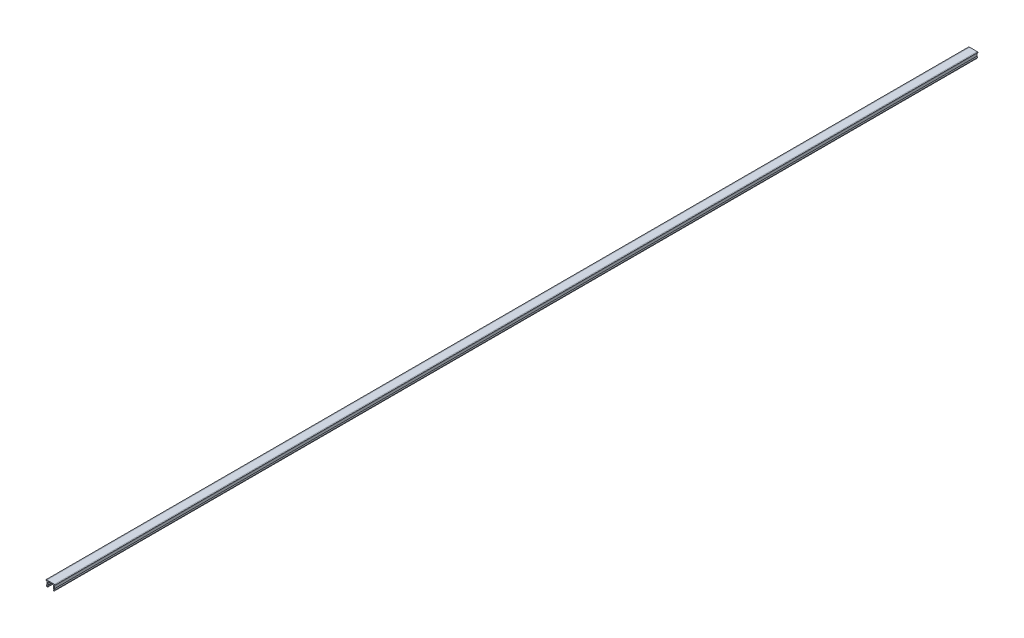
ISO-10303-21;
HEADER;
FILE_DESCRIPTION(('STEP AP214'),'2;1');
FILE_NAME('part.step','',(''),(''),'','','');
FILE_SCHEMA(('AUTOMOTIVE_DESIGN { 1 0 10303 214 1 1 1 1 }'));
ENDSEC;
DATA;
#1=APPLICATION_CONTEXT('core data for automotive mechanical design processes');
#2=APPLICATION_PROTOCOL_DEFINITION('international standard','automotive_design',2000,#1);
#3=PRODUCT_CONTEXT('',#1,'mechanical');
#4=PRODUCT('Part','Part','',(#3));
#5=PRODUCT_RELATED_PRODUCT_CATEGORY('part','',(#4));
#6=PRODUCT_DEFINITION_FORMATION('','',#4);
#7=PRODUCT_DEFINITION_CONTEXT('part definition',#1,'design');
#8=PRODUCT_DEFINITION('design','',#6,#7);
#9=PRODUCT_DEFINITION_SHAPE('','',#8);
#10=(LENGTH_UNIT() NAMED_UNIT(*) SI_UNIT(.MILLI.,.METRE.));
#11=(NAMED_UNIT(*) PLANE_ANGLE_UNIT() SI_UNIT($,.RADIAN.));
#12=(NAMED_UNIT(*) SI_UNIT($,.STERADIAN.) SOLID_ANGLE_UNIT());
#13=UNCERTAINTY_MEASURE_WITH_UNIT(LENGTH_MEASURE(1.E-05),#10,'distance_accuracy_value','');
#14=(GEOMETRIC_REPRESENTATION_CONTEXT(3) GLOBAL_UNCERTAINTY_ASSIGNED_CONTEXT((#13)) GLOBAL_UNIT_ASSIGNED_CONTEXT((#10,
#11,#12)) REPRESENTATION_CONTEXT('',''));
#15=CARTESIAN_POINT('',(0.,0.,0.));
#16=DIRECTION('',(0.,0.,1.));
#17=DIRECTION('',(1.,0.,0.));
#18=AXIS2_PLACEMENT_3D('',#15,#16,#17);
#19=CARTESIAN_POINT('',(-4.1,0.,1000.));
#20=DIRECTION('',(0.,-1.,0.));
#21=DIRECTION('',(1.,0.,0.));
#22=AXIS2_PLACEMENT_3D('',#19,#20,#21);
#23=PLANE('',#22);
#24=DIRECTION('',(-1.,0.,0.));
#25=VECTOR('',#24,1.);
#26=CARTESIAN_POINT('',(-4.1,0.,0.));
#27=LINE('',#26,#25);
#28=CARTESIAN_POINT('',(4.1,0.,0.));
#29=VERTEX_POINT('',#28);
#30=CARTESIAN_POINT('',(-4.1,0.,0.));
#31=VERTEX_POINT('',#30);
#32=EDGE_CURVE('E215',#29,#31,#27,.T.);
#33=ORIENTED_EDGE('',*,*,#32,.T.);
#34=DIRECTION('',(0.,0.,-1.));
#35=VECTOR('',#34,1.);
#36=CARTESIAN_POINT('',(-4.1,0.,1000.));
#37=LINE('',#36,#35);
#38=CARTESIAN_POINT('',(-4.1,0.,1000.));
#39=VERTEX_POINT('',#38);
#40=EDGE_CURVE('E11',#39,#31,#37,.T.);
#41=ORIENTED_EDGE('',*,*,#40,.F.);
#42=DIRECTION('',(-1.,0.,0.));
#43=VECTOR('',#42,1.);
#44=CARTESIAN_POINT('',(-4.1,0.,1000.));
#45=LINE('',#44,#43);
#46=CARTESIAN_POINT('',(4.1,0.,1000.));
#47=VERTEX_POINT('',#46);
#48=EDGE_CURVE('E257',#47,#39,#45,.T.);
#49=ORIENTED_EDGE('',*,*,#48,.F.);
#50=DIRECTION('',(0.,0.,-1.));
#51=VECTOR('',#50,1.);
#52=CARTESIAN_POINT('',(4.1,0.,1000.));
#53=LINE('',#52,#51);
#54=EDGE_CURVE('E211',#47,#29,#53,.T.);
#55=ORIENTED_EDGE('',*,*,#54,.T.);
#56=EDGE_LOOP('',(#33,#41,#49,#55));
#57=FACE_BOUND('',#56,.T.);
#58=ADVANCED_FACE('F35',(#57),#23,.F.);
#59=CARTESIAN_POINT('',(-4.1,0.,1000.));
#60=DIRECTION('',(0.173648177666924,-0.984807753012209,0.));
#61=DIRECTION('',(0.984807753012209,0.173648177666924,0.));
#62=AXIS2_PLACEMENT_3D('',#59,#60,#61);
#63=PLANE('',#62);
#64=DIRECTION('',(-0.984807753012209,-0.173648177666924,0.));
#65=VECTOR('',#64,1.);
#66=CARTESIAN_POINT('',(-4.1,0.,0.));
#67=LINE('',#66,#65);
#68=CARTESIAN_POINT('',(-5.,-0.158694282637612,0.));
#69=VERTEX_POINT('',#68);
#70=EDGE_CURVE('E218',#31,#69,#67,.T.);
#71=ORIENTED_EDGE('',*,*,#70,.T.);
#72=DIRECTION('',(0.,0.,-1.));
#73=VECTOR('',#72,1.);
#74=CARTESIAN_POINT('',(-5.,-0.158694282637612,1000.));
#75=LINE('',#74,#73);
#76=CARTESIAN_POINT('',(-5.,-0.158694282637612,1000.));
#77=VERTEX_POINT('',#76);
#78=EDGE_CURVE('E43',#77,#69,#75,.T.);
#79=ORIENTED_EDGE('',*,*,#78,.F.);
#80=DIRECTION('',(-0.984807753012209,-0.173648177666924,0.));
#81=VECTOR('',#80,1.);
#82=CARTESIAN_POINT('',(-4.1,0.,1000.));
#83=LINE('',#82,#81);
#84=EDGE_CURVE('E136',#39,#77,#83,.T.);
#85=ORIENTED_EDGE('',*,*,#84,.F.);
#86=ORIENTED_EDGE('',*,*,#40,.T.);
#87=EDGE_LOOP('',(#71,#79,#85,#86));
#88=FACE_BOUND('',#87,.T.);
#89=ADVANCED_FACE('F385',(#88),#63,.F.);
#90=CARTESIAN_POINT('',(-5.,-0.158694282637612,1000.));
#91=DIRECTION('',(1.,0.,0.));
#92=DIRECTION('',(0.,0.,-1.));
#93=AXIS2_PLACEMENT_3D('',#90,#91,#92);
#94=PLANE('',#93);
#95=DIRECTION('',(0.,-1.,0.));
#96=VECTOR('',#95,1.);
#97=CARTESIAN_POINT('',(-5.,-0.158694282637612,0.));
#98=LINE('',#97,#96);
#99=CARTESIAN_POINT('',(-5.,-0.8,0.));
#100=VERTEX_POINT('',#99);
#101=EDGE_CURVE('E220',#69,#100,#98,.T.);
#102=ORIENTED_EDGE('',*,*,#101,.T.);
#103=DIRECTION('',(0.,0.,-1.));
#104=VECTOR('',#103,1.);
#105=CARTESIAN_POINT('',(-5.,-0.8,1000.));
#106=LINE('',#105,#104);
#107=CARTESIAN_POINT('',(-5.,-0.8,1000.));
#108=VERTEX_POINT('',#107);
#109=EDGE_CURVE('E306',#108,#100,#106,.T.);
#110=ORIENTED_EDGE('',*,*,#109,.F.);
#111=DIRECTION('',(0.,-1.,0.));
#112=VECTOR('',#111,1.);
#113=CARTESIAN_POINT('',(-5.,-0.158694282637612,1000.));
#114=LINE('',#113,#112);
#115=EDGE_CURVE('E314',#77,#108,#114,.T.);
#116=ORIENTED_EDGE('',*,*,#115,.F.);
#117=ORIENTED_EDGE('',*,*,#78,.T.);
#118=EDGE_LOOP('',(#102,#110,#116,#117));
#119=FACE_BOUND('',#118,.T.);
#120=ADVANCED_FACE('F312',(#119),#94,.F.);
#121=CARTESIAN_POINT('',(-5.,-0.8,1000.));
#122=DIRECTION('',(0.,1.,0.));
#123=DIRECTION('',(0.,0.,1.));
#124=AXIS2_PLACEMENT_3D('',#121,#122,#123);
#125=PLANE('',#124);
#126=DIRECTION('',(1.,0.,0.));
#127=VECTOR('',#126,1.);
#128=CARTESIAN_POINT('',(-5.,-0.8,0.));
#129=LINE('',#128,#127);
#130=CARTESIAN_POINT('',(-4.1,-0.8,0.));
#131=VERTEX_POINT('',#130);
#132=EDGE_CURVE('E222',#100,#131,#129,.T.);
#133=ORIENTED_EDGE('',*,*,#132,.T.);
#134=DIRECTION('',(0.,0.,-1.));
#135=VECTOR('',#134,1.);
#136=CARTESIAN_POINT('',(-4.1,-0.8,1000.));
#137=LINE('',#136,#135);
#138=CARTESIAN_POINT('',(-4.1,-0.8,1000.));
#139=VERTEX_POINT('',#138);
#140=EDGE_CURVE('E303',#139,#131,#137,.T.);
#141=ORIENTED_EDGE('',*,*,#140,.F.);
#142=DIRECTION('',(1.,0.,0.));
#143=VECTOR('',#142,1.);
#144=CARTESIAN_POINT('',(-5.,-0.8,1000.));
#145=LINE('',#144,#143);
#146=EDGE_CURVE('E332',#108,#139,#145,.T.);
#147=ORIENTED_EDGE('',*,*,#146,.F.);
#148=ORIENTED_EDGE('',*,*,#109,.T.);
#149=EDGE_LOOP('',(#133,#141,#147,#148));
#150=FACE_BOUND('',#149,.T.);
#151=ADVANCED_FACE('F323',(#150),#125,.F.);
#152=CARTESIAN_POINT('',(-4.1,-0.8,1000.));
#153=DIRECTION('',(1.,0.,0.));
#154=DIRECTION('',(0.,0.,-1.));
#155=AXIS2_PLACEMENT_3D('',#152,#153,#154);
#156=PLANE('',#155);
#157=DIRECTION('',(0.,-1.,0.));
#158=VECTOR('',#157,1.);
#159=CARTESIAN_POINT('',(-4.1,-0.8,0.));
#160=LINE('',#159,#158);
#161=CARTESIAN_POINT('',(-4.1,-4.19615242270663,0.));
#162=VERTEX_POINT('',#161);
#163=EDGE_CURVE('E224',#131,#162,#160,.T.);
#164=ORIENTED_EDGE('',*,*,#163,.T.);
#165=DIRECTION('',(0.,0.,-1.));
#166=VECTOR('',#165,1.);
#167=CARTESIAN_POINT('',(-4.1,-4.19615242270663,1000.));
#168=LINE('',#167,#166);
#169=CARTESIAN_POINT('',(-4.1,-4.19615242270663,1000.));
#170=VERTEX_POINT('',#169);
#171=EDGE_CURVE('E300',#170,#162,#168,.T.);
#172=ORIENTED_EDGE('',*,*,#171,.F.);
#173=DIRECTION('',(0.,-1.,0.));
#174=VECTOR('',#173,1.);
#175=CARTESIAN_POINT('',(-4.1,-0.8,1000.));
#176=LINE('',#175,#174);
#177=EDGE_CURVE('E329',#139,#170,#176,.T.);
#178=ORIENTED_EDGE('',*,*,#177,.F.);
#179=ORIENTED_EDGE('',*,*,#140,.T.);
#180=EDGE_LOOP('',(#164,#172,#178,#179));
#181=FACE_BOUND('',#180,.T.);
#182=ADVANCED_FACE('F327',(#181),#156,.F.);
#183=CARTESIAN_POINT('',(-4.1,-4.19615242270663,1000.));
#184=DIRECTION('',(0.866025403784438,-0.500000000000001,0.));
#185=DIRECTION('',(0.500000000000001,0.866025403784438,0.));
#186=AXIS2_PLACEMENT_3D('',#183,#184,#185);
#187=PLANE('',#186);
#188=DIRECTION('',(-0.500000000000001,-0.866025403784438,0.));
#189=VECTOR('',#188,1.);
#190=CARTESIAN_POINT('',(-4.1,-4.19615242270663,0.));
#191=LINE('',#190,#189);
#192=CARTESIAN_POINT('',(-4.68771324027147,-5.21410161513775,0.));
#193=VERTEX_POINT('',#192);
#194=EDGE_CURVE('E226',#162,#193,#191,.T.);
#195=ORIENTED_EDGE('',*,*,#194,.T.);
#196=DIRECTION('',(0.,0.,-1.));
#197=VECTOR('',#196,1.);
#198=CARTESIAN_POINT('',(-4.68771324027147,-5.21410161513775,1000.));
#199=LINE('',#198,#197);
#200=CARTESIAN_POINT('',(-4.68771324027147,-5.21410161513775,1000.));
#201=VERTEX_POINT('',#200);
#202=EDGE_CURVE('E297',#201,#193,#199,.T.);
#203=ORIENTED_EDGE('',*,*,#202,.F.);
#204=DIRECTION('',(-0.500000000000001,-0.866025403784438,0.));
#205=VECTOR('',#204,1.);
#206=CARTESIAN_POINT('',(-4.1,-4.19615242270663,1000.));
#207=LINE('',#206,#205);
#208=EDGE_CURVE('E331',#170,#201,#207,.T.);
#209=ORIENTED_EDGE('',*,*,#208,.F.);
#210=ORIENTED_EDGE('',*,*,#171,.T.);
#211=EDGE_LOOP('',(#195,#203,#209,#210));
#212=FACE_BOUND('',#211,.T.);
#213=ADVANCED_FACE('F398',(#212),#187,.F.);
#214=CARTESIAN_POINT('',(-4.68771324027147,-5.21410161513775,1000.));
#215=DIRECTION('',(0.866025403784438,0.5,0.));
#216=DIRECTION('',(-0.5,0.866025403784438,0.));
#217=AXIS2_PLACEMENT_3D('',#214,#215,#216);
#218=PLANE('',#217);
#219=DIRECTION('',(0.5,-0.866025403784438,0.));
#220=VECTOR('',#219,1.);
#221=CARTESIAN_POINT('',(-4.68771324027147,-5.21410161513775,0.));
#222=LINE('',#221,#220);
#223=CARTESIAN_POINT('',(-4.1,-6.23205080756888,0.));
#224=VERTEX_POINT('',#223);
#225=EDGE_CURVE('E228',#193,#224,#222,.T.);
#226=ORIENTED_EDGE('',*,*,#225,.T.);
#227=DIRECTION('',(0.,0.,-1.));
#228=VECTOR('',#227,1.);
#229=CARTESIAN_POINT('',(-4.1,-6.23205080756888,1000.));
#230=LINE('',#229,#228);
#231=CARTESIAN_POINT('',(-4.1,-6.23205080756888,1000.));
#232=VERTEX_POINT('',#231);
#233=EDGE_CURVE('E294',#232,#224,#230,.T.);
#234=ORIENTED_EDGE('',*,*,#233,.F.);
#235=DIRECTION('',(0.5,-0.866025403784438,0.));
#236=VECTOR('',#235,1.);
#237=CARTESIAN_POINT('',(-4.68771324027147,-5.21410161513775,1000.));
#238=LINE('',#237,#236);
#239=EDGE_CURVE('E334',#201,#232,#238,.T.);
#240=ORIENTED_EDGE('',*,*,#239,.F.);
#241=ORIENTED_EDGE('',*,*,#202,.T.);
#242=EDGE_LOOP('',(#226,#234,#240,#241));
#243=FACE_BOUND('',#242,.T.);
#244=ADVANCED_FACE('F401',(#243),#218,.F.);
#245=CARTESIAN_POINT('',(-3.63589838486224,-5.96410161513775,1000.));
#246=DIRECTION('',(0.,0.,-1.));
#247=DIRECTION('',(-1.,0.,0.));
#248=AXIS2_PLACEMENT_3D('',#245,#246,#247);
#249=CYLINDRICAL_SURFACE('',#248,0.535898384862246);
#250=CARTESIAN_POINT('',(-3.63589838486224,-5.96410161513775,0.));
#251=DIRECTION('',(0.,0.,1.));
#252=DIRECTION('',(1.,0.,0.));
#253=AXIS2_PLACEMENT_3D('',#250,#251,#252);
#254=CIRCLE('',#253,0.535898384862246);
#255=CARTESIAN_POINT('',(-3.1,-5.96410161513775,0.));
#256=VERTEX_POINT('',#255);
#257=EDGE_CURVE('E230',#224,#256,#254,.T.);
#258=ORIENTED_EDGE('',*,*,#257,.T.);
#259=DIRECTION('',(0.,0.,-1.));
#260=VECTOR('',#259,1.);
#261=CARTESIAN_POINT('',(-3.1,-5.96410161513775,1000.));
#262=LINE('',#261,#260);
#263=CARTESIAN_POINT('',(-3.1,-5.96410161513775,1000.));
#264=VERTEX_POINT('',#263);
#265=EDGE_CURVE('E291',#264,#256,#262,.T.);
#266=ORIENTED_EDGE('',*,*,#265,.F.);
#267=CARTESIAN_POINT('',(-3.63589838486224,-5.96410161513775,1000.));
#268=DIRECTION('',(0.,0.,1.));
#269=DIRECTION('',(1.,0.,0.));
#270=AXIS2_PLACEMENT_3D('',#267,#268,#269);
#271=CIRCLE('',#270,0.535898384862246);
#272=EDGE_CURVE('E340',#232,#264,#271,.T.);
#273=ORIENTED_EDGE('',*,*,#272,.F.);
#274=ORIENTED_EDGE('',*,*,#233,.T.);
#275=EDGE_LOOP('',(#258,#266,#273,#274));
#276=FACE_BOUND('',#275,.T.);
#277=ADVANCED_FACE('F405',(#276),#249,.T.);
#278=CARTESIAN_POINT('',(-3.1,-5.96410161513775,1000.));
#279=DIRECTION('',(-0.866025403784438,-0.500000000000002,0.));
#280=DIRECTION('',(0.500000000000002,-0.866025403784438,0.));
#281=AXIS2_PLACEMENT_3D('',#278,#279,#280);
#282=PLANE('',#281);
#283=DIRECTION('',(-0.500000000000002,0.866025403784438,0.));
#284=VECTOR('',#283,1.);
#285=CARTESIAN_POINT('',(-3.1,-5.96410161513775,0.));
#286=LINE('',#285,#284);
#287=CARTESIAN_POINT('',(-3.53301270189222,-5.21410161513776,0.));
#288=VERTEX_POINT('',#287);
#289=EDGE_CURVE('E232',#256,#288,#286,.T.);
#290=ORIENTED_EDGE('',*,*,#289,.T.);
#291=DIRECTION('',(0.,0.,-1.));
#292=VECTOR('',#291,1.);
#293=CARTESIAN_POINT('',(-3.53301270189222,-5.21410161513776,1000.));
#294=LINE('',#293,#292);
#295=CARTESIAN_POINT('',(-3.53301270189222,-5.21410161513776,1000.));
#296=VERTEX_POINT('',#295);
#297=EDGE_CURVE('E288',#296,#288,#294,.T.);
#298=ORIENTED_EDGE('',*,*,#297,.F.);
#299=DIRECTION('',(-0.500000000000002,0.866025403784438,0.));
#300=VECTOR('',#299,1.);
#301=CARTESIAN_POINT('',(-3.1,-5.96410161513775,1000.));
#302=LINE('',#301,#300);
#303=EDGE_CURVE('E342',#264,#296,#302,.T.);
#304=ORIENTED_EDGE('',*,*,#303,.F.);
#305=ORIENTED_EDGE('',*,*,#265,.T.);
#306=EDGE_LOOP('',(#290,#298,#304,#305));
#307=FACE_BOUND('',#306,.T.);
#308=ADVANCED_FACE('F409',(#307),#282,.F.);
#309=CARTESIAN_POINT('',(-3.53301270189222,-5.21410161513776,1000.));
#310=DIRECTION('',(-0.866025403784438,0.500000000000001,0.));
#311=DIRECTION('',(-0.500000000000001,-0.866025403784438,0.));
#312=AXIS2_PLACEMENT_3D('',#309,#310,#311);
#313=PLANE('',#312);
#314=DIRECTION('',(0.500000000000001,0.866025403784438,0.));
#315=VECTOR('',#314,1.);
#316=CARTESIAN_POINT('',(-3.53301270189222,-5.21410161513776,0.));
#317=LINE('',#316,#315);
#318=CARTESIAN_POINT('',(-3.1,-4.46410161513775,0.));
#319=VERTEX_POINT('',#318);
#320=EDGE_CURVE('E234',#288,#319,#317,.T.);
#321=ORIENTED_EDGE('',*,*,#320,.T.);
#322=DIRECTION('',(0.,0.,-1.));
#323=VECTOR('',#322,1.);
#324=CARTESIAN_POINT('',(-3.1,-4.46410161513775,1000.));
#325=LINE('',#324,#323);
#326=CARTESIAN_POINT('',(-3.1,-4.46410161513775,1000.));
#327=VERTEX_POINT('',#326);
#328=EDGE_CURVE('E285',#327,#319,#325,.T.);
#329=ORIENTED_EDGE('',*,*,#328,.F.);
#330=DIRECTION('',(0.500000000000001,0.866025403784438,0.));
#331=VECTOR('',#330,1.);
#332=CARTESIAN_POINT('',(-3.53301270189222,-5.21410161513776,1000.));
#333=LINE('',#332,#331);
#334=EDGE_CURVE('E344',#296,#327,#333,.T.);
#335=ORIENTED_EDGE('',*,*,#334,.F.);
#336=ORIENTED_EDGE('',*,*,#297,.T.);
#337=EDGE_LOOP('',(#321,#329,#335,#336));
#338=FACE_BOUND('',#337,.T.);
#339=ADVANCED_FACE('F413',(#338),#313,.F.);
#340=CARTESIAN_POINT('',(-3.1,-4.46410161513775,1000.));
#341=DIRECTION('',(-1.,0.,0.));
#342=DIRECTION('',(0.,-1.,0.));
#343=AXIS2_PLACEMENT_3D('',#340,#341,#342);
#344=PLANE('',#343);
#345=DIRECTION('',(0.,1.,0.));
#346=VECTOR('',#345,1.);
#347=CARTESIAN_POINT('',(-3.1,-4.46410161513775,0.));
#348=LINE('',#347,#346);
#349=CARTESIAN_POINT('',(-3.1,-1.,0.));
#350=VERTEX_POINT('',#349);
#351=EDGE_CURVE('E236',#319,#350,#348,.T.);
#352=ORIENTED_EDGE('',*,*,#351,.T.);
#353=DIRECTION('',(0.,0.,-1.));
#354=VECTOR('',#353,1.);
#355=CARTESIAN_POINT('',(-3.1,-1.,1000.));
#356=LINE('',#355,#354);
#357=CARTESIAN_POINT('',(-3.1,-1.,1000.));
#358=VERTEX_POINT('',#357);
#359=EDGE_CURVE('E282',#358,#350,#356,.T.);
#360=ORIENTED_EDGE('',*,*,#359,.F.);
#361=DIRECTION('',(0.,1.,0.));
#362=VECTOR('',#361,1.);
#363=CARTESIAN_POINT('',(-3.1,-4.46410161513775,1000.));
#364=LINE('',#363,#362);
#365=EDGE_CURVE('E346',#327,#358,#364,.T.);
#366=ORIENTED_EDGE('',*,*,#365,.F.);
#367=ORIENTED_EDGE('',*,*,#328,.T.);
#368=EDGE_LOOP('',(#352,#360,#366,#367));
#369=FACE_BOUND('',#368,.T.);
#370=ADVANCED_FACE('F417',(#369),#344,.F.);
#371=CARTESIAN_POINT('',(-3.1,-1.,1000.));
#372=DIRECTION('',(0.,1.,0.));
#373=DIRECTION('',(-1.,0.,0.));
#374=AXIS2_PLACEMENT_3D('',#371,#372,#373);
#375=PLANE('',#374);
#376=DIRECTION('',(1.,0.,0.));
#377=VECTOR('',#376,1.);
#378=CARTESIAN_POINT('',(-3.1,-1.,0.));
#379=LINE('',#378,#377);
#380=CARTESIAN_POINT('',(3.1,-0.999999999999999,0.));
#381=VERTEX_POINT('',#380);
#382=EDGE_CURVE('E238',#350,#381,#379,.T.);
#383=ORIENTED_EDGE('',*,*,#382,.T.);
#384=DIRECTION('',(0.,0.,-1.));
#385=VECTOR('',#384,1.);
#386=CARTESIAN_POINT('',(3.1,-0.999999999999999,1000.));
#387=LINE('',#386,#385);
#388=CARTESIAN_POINT('',(3.1,-0.999999999999999,1000.));
#389=VERTEX_POINT('',#388);
#390=EDGE_CURVE('E279',#389,#381,#387,.T.);
#391=ORIENTED_EDGE('',*,*,#390,.F.);
#392=DIRECTION('',(1.,0.,0.));
#393=VECTOR('',#392,1.);
#394=CARTESIAN_POINT('',(-3.1,-1.,1000.));
#395=LINE('',#394,#393);
#396=EDGE_CURVE('E348',#358,#389,#395,.T.);
#397=ORIENTED_EDGE('',*,*,#396,.F.);
#398=ORIENTED_EDGE('',*,*,#359,.T.);
#399=EDGE_LOOP('',(#383,#391,#397,#398));
#400=FACE_BOUND('',#399,.T.);
#401=ADVANCED_FACE('F421',(#400),#375,.F.);
#402=CARTESIAN_POINT('',(3.1,-4.46410161513775,1000.));
#403=DIRECTION('',(1.,0.,0.));
#404=DIRECTION('',(0.,0.,-1.));
#405=AXIS2_PLACEMENT_3D('',#402,#403,#404);
#406=PLANE('',#405);
#407=DIRECTION('',(0.,-1.,0.));
#408=VECTOR('',#407,1.);
#409=CARTESIAN_POINT('',(3.1,-4.46410161513775,0.));
#410=LINE('',#409,#408);
#411=CARTESIAN_POINT('',(3.1,-4.46410161513775,0.));
#412=VERTEX_POINT('',#411);
#413=EDGE_CURVE('E240',#381,#412,#410,.T.);
#414=ORIENTED_EDGE('',*,*,#413,.T.);
#415=DIRECTION('',(0.,0.,-1.));
#416=VECTOR('',#415,1.);
#417=CARTESIAN_POINT('',(3.1,-4.46410161513775,1000.));
#418=LINE('',#417,#416);
#419=CARTESIAN_POINT('',(3.1,-4.46410161513775,1000.));
#420=VERTEX_POINT('',#419);
#421=EDGE_CURVE('E276',#420,#412,#418,.T.);
#422=ORIENTED_EDGE('',*,*,#421,.F.);
#423=DIRECTION('',(0.,-1.,0.));
#424=VECTOR('',#423,1.);
#425=CARTESIAN_POINT('',(3.1,-4.46410161513775,1000.));
#426=LINE('',#425,#424);
#427=EDGE_CURVE('E350',#389,#420,#426,.T.);
#428=ORIENTED_EDGE('',*,*,#427,.F.);
#429=ORIENTED_EDGE('',*,*,#390,.T.);
#430=EDGE_LOOP('',(#414,#422,#428,#429));
#431=FACE_BOUND('',#430,.T.);
#432=ADVANCED_FACE('F425',(#431),#406,.F.);
#433=CARTESIAN_POINT('',(3.53301270189222,-5.21410161513775,1000.));
#434=DIRECTION('',(0.866025403784438,0.500000000000001,0.));
#435=DIRECTION('',(-0.500000000000001,0.866025403784438,0.));
#436=AXIS2_PLACEMENT_3D('',#433,#434,#435);
#437=PLANE('',#436);
#438=DIRECTION('',(0.500000000000001,-0.866025403784438,0.));
#439=VECTOR('',#438,1.);
#440=CARTESIAN_POINT('',(3.53301270189222,-5.21410161513775,0.));
#441=LINE('',#440,#439);
#442=CARTESIAN_POINT('',(3.53301270189222,-5.21410161513775,0.));
#443=VERTEX_POINT('',#442);
#444=EDGE_CURVE('E242',#412,#443,#441,.T.);
#445=ORIENTED_EDGE('',*,*,#444,.T.);
#446=DIRECTION('',(0.,0.,-1.));
#447=VECTOR('',#446,1.);
#448=CARTESIAN_POINT('',(3.53301270189222,-5.21410161513775,1000.));
#449=LINE('',#448,#447);
#450=CARTESIAN_POINT('',(3.53301270189222,-5.21410161513775,1000.));
#451=VERTEX_POINT('',#450);
#452=EDGE_CURVE('E273',#451,#443,#449,.T.);
#453=ORIENTED_EDGE('',*,*,#452,.F.);
#454=DIRECTION('',(0.500000000000001,-0.866025403784438,0.));
#455=VECTOR('',#454,1.);
#456=CARTESIAN_POINT('',(3.53301270189222,-5.21410161513775,1000.));
#457=LINE('',#456,#455);
#458=EDGE_CURVE('E352',#420,#451,#457,.T.);
#459=ORIENTED_EDGE('',*,*,#458,.F.);
#460=ORIENTED_EDGE('',*,*,#421,.T.);
#461=EDGE_LOOP('',(#445,#453,#459,#460));
#462=FACE_BOUND('',#461,.T.);
#463=ADVANCED_FACE('F429',(#462),#437,.F.);
#464=CARTESIAN_POINT('',(3.1,-5.96410161513775,1000.));
#465=DIRECTION('',(0.866025403784438,-0.500000000000001,0.));
#466=DIRECTION('',(0.500000000000001,0.866025403784438,0.));
#467=AXIS2_PLACEMENT_3D('',#464,#465,#466);
#468=PLANE('',#467);
#469=DIRECTION('',(-0.500000000000001,-0.866025403784438,0.));
#470=VECTOR('',#469,1.);
#471=CARTESIAN_POINT('',(3.1,-5.96410161513775,0.));
#472=LINE('',#471,#470);
#473=CARTESIAN_POINT('',(3.1,-5.96410161513775,0.));
#474=VERTEX_POINT('',#473);
#475=EDGE_CURVE('E244',#443,#474,#472,.T.);
#476=ORIENTED_EDGE('',*,*,#475,.T.);
#477=DIRECTION('',(0.,0.,-1.));
#478=VECTOR('',#477,1.);
#479=CARTESIAN_POINT('',(3.1,-5.96410161513775,1000.));
#480=LINE('',#479,#478);
#481=CARTESIAN_POINT('',(3.1,-5.96410161513775,1000.));
#482=VERTEX_POINT('',#481);
#483=EDGE_CURVE('E270',#482,#474,#480,.T.);
#484=ORIENTED_EDGE('',*,*,#483,.F.);
#485=DIRECTION('',(-0.500000000000001,-0.866025403784438,0.));
#486=VECTOR('',#485,1.);
#487=CARTESIAN_POINT('',(3.1,-5.96410161513775,1000.));
#488=LINE('',#487,#486);
#489=EDGE_CURVE('E354',#451,#482,#488,.T.);
#490=ORIENTED_EDGE('',*,*,#489,.F.);
#491=ORIENTED_EDGE('',*,*,#452,.T.);
#492=EDGE_LOOP('',(#476,#484,#490,#491));
#493=FACE_BOUND('',#492,.T.);
#494=ADVANCED_FACE('F433',(#493),#468,.F.);
#495=CARTESIAN_POINT('',(3.63589838486225,-5.96410161513775,1000.));
#496=DIRECTION('',(0.,0.,-1.));
#497=DIRECTION('',(-1.,0.,0.));
#498=AXIS2_PLACEMENT_3D('',#495,#496,#497);
#499=CYLINDRICAL_SURFACE('',#498,0.535898384862246);
#500=CARTESIAN_POINT('',(3.63589838486225,-5.96410161513775,0.));
#501=DIRECTION('',(0.,0.,1.));
#502=DIRECTION('',(-1.,0.,0.));
#503=AXIS2_PLACEMENT_3D('',#500,#501,#502);
#504=CIRCLE('',#503,0.535898384862246);
#505=CARTESIAN_POINT('',(4.1,-6.23205080756888,0.));
#506=VERTEX_POINT('',#505);
#507=EDGE_CURVE('E246',#474,#506,#504,.T.);
#508=ORIENTED_EDGE('',*,*,#507,.T.);
#509=DIRECTION('',(0.,0.,-1.));
#510=VECTOR('',#509,1.);
#511=CARTESIAN_POINT('',(4.1,-6.23205080756888,1000.));
#512=LINE('',#511,#510);
#513=CARTESIAN_POINT('',(4.1,-6.23205080756888,1000.));
#514=VERTEX_POINT('',#513);
#515=EDGE_CURVE('E267',#514,#506,#512,.T.);
#516=ORIENTED_EDGE('',*,*,#515,.F.);
#517=CARTESIAN_POINT('',(3.63589838486225,-5.96410161513775,1000.));
#518=DIRECTION('',(0.,0.,1.));
#519=DIRECTION('',(-1.,0.,0.));
#520=AXIS2_PLACEMENT_3D('',#517,#518,#519);
#521=CIRCLE('',#520,0.535898384862246);
#522=EDGE_CURVE('E356',#482,#514,#521,.T.);
#523=ORIENTED_EDGE('',*,*,#522,.F.);
#524=ORIENTED_EDGE('',*,*,#483,.T.);
#525=EDGE_LOOP('',(#508,#516,#523,#524));
#526=FACE_BOUND('',#525,.T.);
#527=ADVANCED_FACE('F437',(#526),#499,.T.);
#528=CARTESIAN_POINT('',(4.68771324027147,-5.21410161513775,1000.));
#529=DIRECTION('',(-0.866025403784438,0.5,0.));
#530=DIRECTION('',(-0.5,-0.866025403784438,0.));
#531=AXIS2_PLACEMENT_3D('',#528,#529,#530);
#532=PLANE('',#531);
#533=DIRECTION('',(0.5,0.866025403784438,0.));
#534=VECTOR('',#533,1.);
#535=CARTESIAN_POINT('',(4.68771324027147,-5.21410161513775,0.));
#536=LINE('',#535,#534);
#537=CARTESIAN_POINT('',(4.68771324027147,-5.21410161513775,0.));
#538=VERTEX_POINT('',#537);
#539=EDGE_CURVE('E248',#506,#538,#536,.T.);
#540=ORIENTED_EDGE('',*,*,#539,.T.);
#541=DIRECTION('',(0.,0.,-1.));
#542=VECTOR('',#541,1.);
#543=CARTESIAN_POINT('',(4.68771324027147,-5.21410161513775,1000.));
#544=LINE('',#543,#542);
#545=CARTESIAN_POINT('',(4.68771324027147,-5.21410161513775,1000.));
#546=VERTEX_POINT('',#545);
#547=EDGE_CURVE('E264',#546,#538,#544,.T.);
#548=ORIENTED_EDGE('',*,*,#547,.F.);
#549=DIRECTION('',(0.5,0.866025403784438,0.));
#550=VECTOR('',#549,1.);
#551=CARTESIAN_POINT('',(4.68771324027147,-5.21410161513775,1000.));
#552=LINE('',#551,#550);
#553=EDGE_CURVE('E358',#514,#546,#552,.T.);
#554=ORIENTED_EDGE('',*,*,#553,.F.);
#555=ORIENTED_EDGE('',*,*,#515,.T.);
#556=EDGE_LOOP('',(#540,#548,#554,#555));
#557=FACE_BOUND('',#556,.T.);
#558=ADVANCED_FACE('F441',(#557),#532,.F.);
#559=CARTESIAN_POINT('',(4.1,-4.19615242270663,1000.));
#560=DIRECTION('',(-0.866025403784438,-0.500000000000001,0.));
#561=DIRECTION('',(0.500000000000001,-0.866025403784438,0.));
#562=AXIS2_PLACEMENT_3D('',#559,#560,#561);
#563=PLANE('',#562);
#564=DIRECTION('',(-0.500000000000001,0.866025403784438,0.));
#565=VECTOR('',#564,1.);
#566=CARTESIAN_POINT('',(4.1,-4.19615242270663,0.));
#567=LINE('',#566,#565);
#568=CARTESIAN_POINT('',(4.1,-4.19615242270663,0.));
#569=VERTEX_POINT('',#568);
#570=EDGE_CURVE('E250',#538,#569,#567,.T.);
#571=ORIENTED_EDGE('',*,*,#570,.T.);
#572=DIRECTION('',(0.,0.,-1.));
#573=VECTOR('',#572,1.);
#574=CARTESIAN_POINT('',(4.1,-4.19615242270663,1000.));
#575=LINE('',#574,#573);
#576=CARTESIAN_POINT('',(4.1,-4.19615242270663,1000.));
#577=VERTEX_POINT('',#576);
#578=EDGE_CURVE('E261',#577,#569,#575,.T.);
#579=ORIENTED_EDGE('',*,*,#578,.F.);
#580=DIRECTION('',(-0.500000000000001,0.866025403784438,0.));
#581=VECTOR('',#580,1.);
#582=CARTESIAN_POINT('',(4.1,-4.19615242270663,1000.));
#583=LINE('',#582,#581);
#584=EDGE_CURVE('E360',#546,#577,#583,.T.);
#585=ORIENTED_EDGE('',*,*,#584,.F.);
#586=ORIENTED_EDGE('',*,*,#547,.T.);
#587=EDGE_LOOP('',(#571,#579,#585,#586));
#588=FACE_BOUND('',#587,.T.);
#589=ADVANCED_FACE('F366',(#588),#563,.F.);
#590=CARTESIAN_POINT('',(4.1,-0.799999999999999,1000.));
#591=DIRECTION('',(-1.,0.,0.));
#592=DIRECTION('',(0.,-1.,0.));
#593=AXIS2_PLACEMENT_3D('',#590,#591,#592);
#594=PLANE('',#593);
#595=DIRECTION('',(0.,1.,0.));
#596=VECTOR('',#595,1.);
#597=CARTESIAN_POINT('',(4.1,-0.799999999999999,0.));
#598=LINE('',#597,#596);
#599=CARTESIAN_POINT('',(4.1,-0.799999999999999,0.));
#600=VERTEX_POINT('',#599);
#601=EDGE_CURVE('E252',#569,#600,#598,.T.);
#602=ORIENTED_EDGE('',*,*,#601,.T.);
#603=DIRECTION('',(0.,0.,-1.));
#604=VECTOR('',#603,1.);
#605=CARTESIAN_POINT('',(4.1,-0.799999999999999,1000.));
#606=LINE('',#605,#604);
#607=CARTESIAN_POINT('',(4.1,-0.799999999999999,1000.));
#608=VERTEX_POINT('',#607);
#609=EDGE_CURVE('E206',#608,#600,#606,.T.);
#610=ORIENTED_EDGE('',*,*,#609,.F.);
#611=DIRECTION('',(0.,1.,0.));
#612=VECTOR('',#611,1.);
#613=CARTESIAN_POINT('',(4.1,-0.799999999999999,1000.));
#614=LINE('',#613,#612);
#615=EDGE_CURVE('E197',#577,#608,#614,.T.);
#616=ORIENTED_EDGE('',*,*,#615,.F.);
#617=ORIENTED_EDGE('',*,*,#578,.T.);
#618=EDGE_LOOP('',(#602,#610,#616,#617));
#619=FACE_BOUND('',#618,.T.);
#620=ADVANCED_FACE('F370',(#619),#594,.F.);
#621=CARTESIAN_POINT('',(5.,-0.799999999999999,1000.));
#622=DIRECTION('',(0.,1.,0.));
#623=DIRECTION('',(-1.,0.,0.));
#624=AXIS2_PLACEMENT_3D('',#621,#622,#623);
#625=PLANE('',#624);
#626=DIRECTION('',(1.,0.,0.));
#627=VECTOR('',#626,1.);
#628=CARTESIAN_POINT('',(5.,-0.799999999999999,0.));
#629=LINE('',#628,#627);
#630=CARTESIAN_POINT('',(5.,-0.799999999999999,0.));
#631=VERTEX_POINT('',#630);
#632=EDGE_CURVE('E205',#600,#631,#629,.T.);
#633=ORIENTED_EDGE('',*,*,#632,.T.);
#634=DIRECTION('',(0.,0.,-1.));
#635=VECTOR('',#634,1.);
#636=CARTESIAN_POINT('',(5.,-0.799999999999999,1000.));
#637=LINE('',#636,#635);
#638=CARTESIAN_POINT('',(5.,-0.799999999999999,1000.));
#639=VERTEX_POINT('',#638);
#640=EDGE_CURVE('E202',#639,#631,#637,.T.);
#641=ORIENTED_EDGE('',*,*,#640,.F.);
#642=DIRECTION('',(1.,0.,0.));
#643=VECTOR('',#642,1.);
#644=CARTESIAN_POINT('',(5.,-0.799999999999999,1000.));
#645=LINE('',#644,#643);
#646=EDGE_CURVE('E191',#608,#639,#645,.T.);
#647=ORIENTED_EDGE('',*,*,#646,.F.);
#648=ORIENTED_EDGE('',*,*,#609,.T.);
#649=EDGE_LOOP('',(#633,#641,#647,#648));
#650=FACE_BOUND('',#649,.T.);
#651=ADVANCED_FACE('F203',(#650),#625,.F.);
#652=CARTESIAN_POINT('',(5.,-0.158694282637611,1000.));
#653=DIRECTION('',(-1.,0.,0.));
#654=DIRECTION('',(0.,0.,1.));
#655=AXIS2_PLACEMENT_3D('',#652,#653,#654);
#656=PLANE('',#655);
#657=DIRECTION('',(0.,1.,0.));
#658=VECTOR('',#657,1.);
#659=CARTESIAN_POINT('',(5.,-0.158694282637611,0.));
#660=LINE('',#659,#658);
#661=CARTESIAN_POINT('',(5.,-0.158694282637611,0.));
#662=VERTEX_POINT('',#661);
#663=EDGE_CURVE('E122',#631,#662,#660,.T.);
#664=ORIENTED_EDGE('',*,*,#663,.T.);
#665=DIRECTION('',(0.,0.,-1.));
#666=VECTOR('',#665,1.);
#667=CARTESIAN_POINT('',(5.,-0.158694282637611,1000.));
#668=LINE('',#667,#666);
#669=CARTESIAN_POINT('',(5.,-0.158694282637611,1000.));
#670=VERTEX_POINT('',#669);
#671=EDGE_CURVE('E207',#670,#662,#668,.T.);
#672=ORIENTED_EDGE('',*,*,#671,.F.);
#673=DIRECTION('',(0.,1.,0.));
#674=VECTOR('',#673,1.);
#675=CARTESIAN_POINT('',(5.,-0.158694282637611,1000.));
#676=LINE('',#675,#674);
#677=EDGE_CURVE('E195',#639,#670,#676,.T.);
#678=ORIENTED_EDGE('',*,*,#677,.F.);
#679=ORIENTED_EDGE('',*,*,#640,.T.);
#680=EDGE_LOOP('',(#664,#672,#678,#679));
#681=FACE_BOUND('',#680,.T.);
#682=ADVANCED_FACE('F209',(#681),#656,.F.);
#683=CARTESIAN_POINT('',(4.1,0.,1000.));
#684=DIRECTION('',(-0.173648177666923,-0.984807753012209,0.));
#685=DIRECTION('',(0.984807753012209,-0.173648177666923,0.));
#686=AXIS2_PLACEMENT_3D('',#683,#684,#685);
#687=PLANE('',#686);
#688=DIRECTION('',(-0.984807753012209,0.173648177666923,0.));
#689=VECTOR('',#688,1.);
#690=CARTESIAN_POINT('',(4.1,0.,0.));
#691=LINE('',#690,#689);
#692=EDGE_CURVE('E128',#662,#29,#691,.T.);
#693=ORIENTED_EDGE('',*,*,#692,.T.);
#694=ORIENTED_EDGE('',*,*,#54,.F.);
#695=DIRECTION('',(-0.984807753012209,0.173648177666923,0.));
#696=VECTOR('',#695,1.);
#697=CARTESIAN_POINT('',(4.1,0.,1000.));
#698=LINE('',#697,#696);
#699=EDGE_CURVE('E51',#670,#47,#698,.T.);
#700=ORIENTED_EDGE('',*,*,#699,.F.);
#701=ORIENTED_EDGE('',*,*,#671,.T.);
#702=EDGE_LOOP('',(#693,#694,#700,#701));
#703=FACE_BOUND('',#702,.T.);
#704=ADVANCED_FACE('F374',(#703),#687,.F.);
#705=CARTESIAN_POINT('',(3.63589838486225,-5.96410161513775,1000.));
#706=DIRECTION('',(0.,0.,-1.));
#707=DIRECTION('',(-1.,0.,0.));
#708=AXIS2_PLACEMENT_3D('',#705,#706,#707);
#709=PLANE('',#708);
#710=ORIENTED_EDGE('',*,*,#48,.T.);
#711=ORIENTED_EDGE('',*,*,#84,.T.);
#712=ORIENTED_EDGE('',*,*,#115,.T.);
#713=ORIENTED_EDGE('',*,*,#146,.T.);
#714=ORIENTED_EDGE('',*,*,#177,.T.);
#715=ORIENTED_EDGE('',*,*,#208,.T.);
#716=ORIENTED_EDGE('',*,*,#239,.T.);
#717=ORIENTED_EDGE('',*,*,#272,.T.);
#718=ORIENTED_EDGE('',*,*,#303,.T.);
#719=ORIENTED_EDGE('',*,*,#334,.T.);
#720=ORIENTED_EDGE('',*,*,#365,.T.);
#721=ORIENTED_EDGE('',*,*,#396,.T.);
#722=ORIENTED_EDGE('',*,*,#427,.T.);
#723=ORIENTED_EDGE('',*,*,#458,.T.);
#724=ORIENTED_EDGE('',*,*,#489,.T.);
#725=ORIENTED_EDGE('',*,*,#522,.T.);
#726=ORIENTED_EDGE('',*,*,#553,.T.);
#727=ORIENTED_EDGE('',*,*,#584,.T.);
#728=ORIENTED_EDGE('',*,*,#615,.T.);
#729=ORIENTED_EDGE('',*,*,#646,.T.);
#730=ORIENTED_EDGE('',*,*,#677,.T.);
#731=ORIENTED_EDGE('',*,*,#699,.T.);
#732=EDGE_LOOP('',(#710,#711,#712,#713,#714,#715,#716,#717,#718,#719,#720,#721,#722,#723,#724,
#725,#726,#727,#728,#729,#730,#731));
#733=FACE_BOUND('',#732,.T.);
#734=ADVANCED_FACE('F193',(#733),#709,.F.);
#735=CARTESIAN_POINT('',(3.63589838486225,-5.96410161513775,0.));
#736=DIRECTION('',(0.,0.,-1.));
#737=DIRECTION('',(-1.,0.,0.));
#738=AXIS2_PLACEMENT_3D('',#735,#736,#737);
#739=PLANE('',#738);
#740=ORIENTED_EDGE('',*,*,#32,.F.);
#741=ORIENTED_EDGE('',*,*,#692,.F.);
#742=ORIENTED_EDGE('',*,*,#663,.F.);
#743=ORIENTED_EDGE('',*,*,#632,.F.);
#744=ORIENTED_EDGE('',*,*,#601,.F.);
#745=ORIENTED_EDGE('',*,*,#570,.F.);
#746=ORIENTED_EDGE('',*,*,#539,.F.);
#747=ORIENTED_EDGE('',*,*,#507,.F.);
#748=ORIENTED_EDGE('',*,*,#475,.F.);
#749=ORIENTED_EDGE('',*,*,#444,.F.);
#750=ORIENTED_EDGE('',*,*,#413,.F.);
#751=ORIENTED_EDGE('',*,*,#382,.F.);
#752=ORIENTED_EDGE('',*,*,#351,.F.);
#753=ORIENTED_EDGE('',*,*,#320,.F.);
#754=ORIENTED_EDGE('',*,*,#289,.F.);
#755=ORIENTED_EDGE('',*,*,#257,.F.);
#756=ORIENTED_EDGE('',*,*,#225,.F.);
#757=ORIENTED_EDGE('',*,*,#194,.F.);
#758=ORIENTED_EDGE('',*,*,#163,.F.);
#759=ORIENTED_EDGE('',*,*,#132,.F.);
#760=ORIENTED_EDGE('',*,*,#101,.F.);
#761=ORIENTED_EDGE('',*,*,#70,.F.);
#762=EDGE_LOOP('',(#740,#741,#742,#743,#744,#745,#746,#747,#748,#749,#750,#751,#752,#753,#754,
#755,#756,#757,#758,#759,#760,#761));
#763=FACE_BOUND('',#762,.T.);
#764=ADVANCED_FACE('F318',(#763),#739,.T.);
#765=CLOSED_SHELL('',(#58,#89,#120,#151,#182,#213,#244,#277,#308,#339,#370,#401,#432,#463,#494,
#527,#558,#589,#620,#651,#682,#704,#734,#764));
#766=MANIFOLD_SOLID_BREP('B2',#765);
#767=ADVANCED_BREP_SHAPE_REPRESENTATION('',(#18,#766),#14);
#768=SHAPE_DEFINITION_REPRESENTATION(#9,#767);
ENDSEC;
END-ISO-10303-21;
